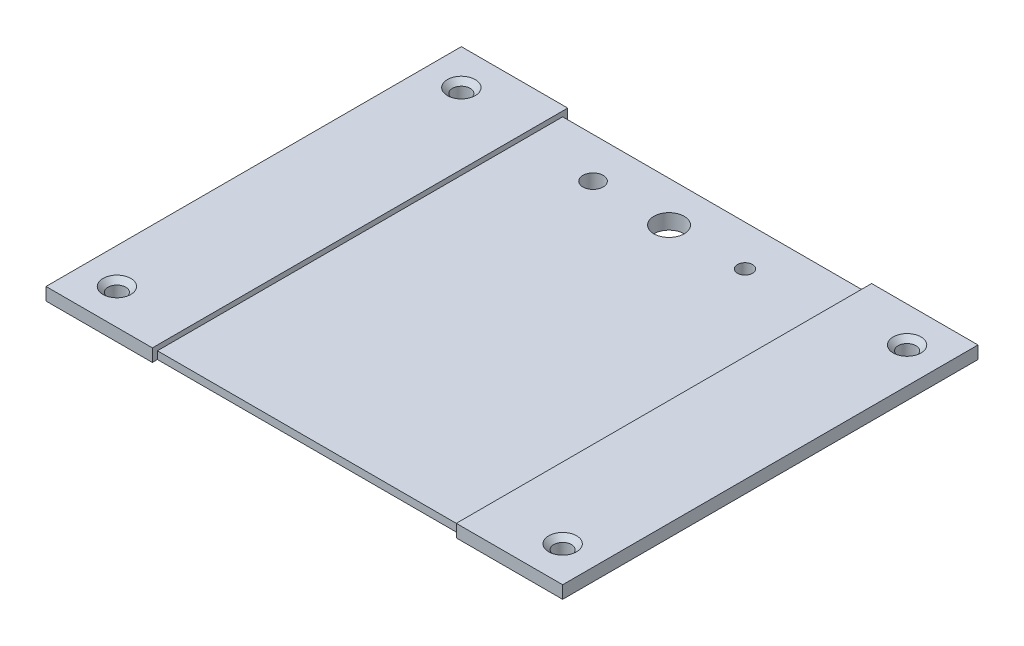
ISO-10303-21;
HEADER;
FILE_DESCRIPTION(('STEP AP214'),'2;1');
FILE_NAME('part.step','',(''),(''),'','','');
FILE_SCHEMA(('AUTOMOTIVE_DESIGN { 1 0 10303 214 1 1 1 1 }'));
ENDSEC;
DATA;
#1=APPLICATION_CONTEXT('core data for automotive mechanical design processes');
#2=APPLICATION_PROTOCOL_DEFINITION('international standard','automotive_design',2000,#1);
#3=PRODUCT_CONTEXT('',#1,'mechanical');
#4=PRODUCT('Part','Part','',(#3));
#5=PRODUCT_RELATED_PRODUCT_CATEGORY('part','',(#4));
#6=PRODUCT_DEFINITION_FORMATION('','',#4);
#7=PRODUCT_DEFINITION_CONTEXT('part definition',#1,'design');
#8=PRODUCT_DEFINITION('design','',#6,#7);
#9=PRODUCT_DEFINITION_SHAPE('','',#8);
#10=(LENGTH_UNIT() NAMED_UNIT(*) SI_UNIT(.MILLI.,.METRE.));
#11=(NAMED_UNIT(*) PLANE_ANGLE_UNIT() SI_UNIT($,.RADIAN.));
#12=(NAMED_UNIT(*) SI_UNIT($,.STERADIAN.) SOLID_ANGLE_UNIT());
#13=UNCERTAINTY_MEASURE_WITH_UNIT(LENGTH_MEASURE(1.E-05),#10,'distance_accuracy_value','');
#14=(GEOMETRIC_REPRESENTATION_CONTEXT(3) GLOBAL_UNCERTAINTY_ASSIGNED_CONTEXT((#13)) GLOBAL_UNIT_ASSIGNED_CONTEXT((#10,
#11,#12)) REPRESENTATION_CONTEXT('',''));
#15=CARTESIAN_POINT('',(0.,0.,0.));
#16=DIRECTION('',(0.,0.,1.));
#17=DIRECTION('',(1.,0.,0.));
#18=AXIS2_PLACEMENT_3D('',#15,#16,#17);
#19=CARTESIAN_POINT('',(0.,1.5,-80.));
#20=DIRECTION('',(0.,0.,1.));
#21=DIRECTION('',(1.,0.,0.));
#22=AXIS2_PLACEMENT_3D('',#19,#20,#21);
#23=PLANE('',#22);
#24=DIRECTION('',(0.,-1.,0.));
#25=VECTOR('',#24,1.);
#26=CARTESIAN_POINT('',(21.,2.5,-80.));
#27=LINE('',#26,#25);
#28=CARTESIAN_POINT('',(21.,1.5,-80.));
#29=VERTEX_POINT('',#28);
#30=CARTESIAN_POINT('',(21.,0.,-80.));
#31=VERTEX_POINT('',#30);
#32=EDGE_CURVE('E174',#29,#31,#27,.T.);
#33=ORIENTED_EDGE('',*,*,#32,.F.);
#34=DIRECTION('',(-1.,0.,0.));
#35=VECTOR('',#34,1.);
#36=CARTESIAN_POINT('',(0.,1.5,-80.));
#37=LINE('',#36,#35);
#38=CARTESIAN_POINT('',(81.,1.5,-80.));
#39=VERTEX_POINT('',#38);
#40=EDGE_CURVE('E247',#39,#29,#37,.T.);
#41=ORIENTED_EDGE('',*,*,#40,.F.);
#42=DIRECTION('',(0.,1.,0.));
#43=VECTOR('',#42,1.);
#44=CARTESIAN_POINT('',(81.,2.5,-80.));
#45=LINE('',#44,#43);
#46=CARTESIAN_POINT('',(81.,0.,-80.));
#47=VERTEX_POINT('',#46);
#48=EDGE_CURVE('E177',#47,#39,#45,.T.);
#49=ORIENTED_EDGE('',*,*,#48,.F.);
#50=DIRECTION('',(-1.,0.,0.));
#51=VECTOR('',#50,1.);
#52=CARTESIAN_POINT('',(0.,0.,-80.));
#53=LINE('',#52,#51);
#54=EDGE_CURVE('E52',#47,#31,#53,.T.);
#55=ORIENTED_EDGE('',*,*,#54,.T.);
#56=EDGE_LOOP('',(#33,#41,#49,#55));
#57=FACE_BOUND('',#56,.T.);
#58=ADVANCED_FACE('F35',(#57),#23,.F.);
#59=CARTESIAN_POINT('',(0.,1.5,0.));
#60=DIRECTION('',(0.,0.,-1.));
#61=DIRECTION('',(-1.,0.,0.));
#62=AXIS2_PLACEMENT_3D('',#59,#60,#61);
#63=PLANE('',#62);
#64=DIRECTION('',(0.,-1.,0.));
#65=VECTOR('',#64,1.);
#66=CARTESIAN_POINT('',(81.,2.5,0.));
#67=LINE('',#66,#65);
#68=CARTESIAN_POINT('',(81.,1.5,0.));
#69=VERTEX_POINT('',#68);
#70=CARTESIAN_POINT('',(81.,0.,0.));
#71=VERTEX_POINT('',#70);
#72=EDGE_CURVE('E201',#69,#71,#67,.T.);
#73=ORIENTED_EDGE('',*,*,#72,.F.);
#74=DIRECTION('',(1.,0.,0.));
#75=VECTOR('',#74,1.);
#76=CARTESIAN_POINT('',(0.,1.5,0.));
#77=LINE('',#76,#75);
#78=CARTESIAN_POINT('',(21.,1.5,0.));
#79=VERTEX_POINT('',#78);
#80=EDGE_CURVE('E250',#79,#69,#77,.T.);
#81=ORIENTED_EDGE('',*,*,#80,.F.);
#82=DIRECTION('',(0.,1.,0.));
#83=VECTOR('',#82,1.);
#84=CARTESIAN_POINT('',(21.,2.5,0.));
#85=LINE('',#84,#83);
#86=CARTESIAN_POINT('',(21.,0.,0.));
#87=VERTEX_POINT('',#86);
#88=EDGE_CURVE('E218',#87,#79,#85,.T.);
#89=ORIENTED_EDGE('',*,*,#88,.F.);
#90=DIRECTION('',(1.,0.,0.));
#91=VECTOR('',#90,1.);
#92=CARTESIAN_POINT('',(0.,0.,0.));
#93=LINE('',#92,#91);
#94=EDGE_CURVE('E60',#87,#71,#93,.T.);
#95=ORIENTED_EDGE('',*,*,#94,.T.);
#96=EDGE_LOOP('',(#73,#81,#89,#95));
#97=FACE_BOUND('',#96,.T.);
#98=ADVANCED_FACE('F311',(#97),#63,.F.);
#99=CARTESIAN_POINT('',(0.,1.5,0.));
#100=DIRECTION('',(0.,-1.,0.));
#101=DIRECTION('',(0.,0.,-1.));
#102=AXIS2_PLACEMENT_3D('',#99,#100,#101);
#103=PLANE('',#102);
#104=CARTESIAN_POINT('',(65.,1.5,-72.));
#105=DIRECTION('',(0.,1.,0.));
#106=DIRECTION('',(0.,0.,1.));
#107=AXIS2_PLACEMENT_3D('',#104,#105,#106);
#108=CIRCLE('',#107,1.49999999999998);
#109=CARTESIAN_POINT('',(65.,1.5,-70.5));
#110=VERTEX_POINT('',#109);
#111=EDGE_CURVE('E240',#110,#110,#108,.T.);
#112=ORIENTED_EDGE('',*,*,#111,.F.);
#113=EDGE_LOOP('',(#112));
#114=FACE_BOUND('',#113,.T.);
#115=CARTESIAN_POINT('',(50.,1.5,-72.));
#116=DIRECTION('',(0.,1.,0.));
#117=DIRECTION('',(0.,0.,1.));
#118=AXIS2_PLACEMENT_3D('',#115,#116,#117);
#119=CIRCLE('',#118,3.);
#120=CARTESIAN_POINT('',(50.,1.5,-69.));
#121=VERTEX_POINT('',#120);
#122=EDGE_CURVE('E297',#121,#121,#119,.T.);
#123=ORIENTED_EDGE('',*,*,#122,.F.);
#124=EDGE_LOOP('',(#123));
#125=FACE_BOUND('',#124,.T.);
#126=CARTESIAN_POINT('',(35.,1.5,-72.));
#127=DIRECTION('',(0.,1.,0.));
#128=DIRECTION('',(0.,0.,1.));
#129=AXIS2_PLACEMENT_3D('',#126,#127,#128);
#130=CIRCLE('',#129,2.);
#131=CARTESIAN_POINT('',(35.,1.5,-70.));
#132=VERTEX_POINT('',#131);
#133=EDGE_CURVE('E294',#132,#132,#130,.T.);
#134=ORIENTED_EDGE('',*,*,#133,.F.);
#135=EDGE_LOOP('',(#134));
#136=FACE_BOUND('',#135,.T.);
#137=DIRECTION('',(0.,0.,-1.));
#138=VECTOR('',#137,1.);
#139=CARTESIAN_POINT('',(21.,1.5,-80.));
#140=LINE('',#139,#138);
#141=EDGE_CURVE('E233',#79,#29,#140,.T.);
#142=ORIENTED_EDGE('',*,*,#141,.F.);
#143=ORIENTED_EDGE('',*,*,#80,.T.);
#144=DIRECTION('',(0.,0.,1.));
#145=VECTOR('',#144,1.);
#146=CARTESIAN_POINT('',(81.,1.5,-80.));
#147=LINE('',#146,#145);
#148=EDGE_CURVE('E235',#39,#69,#147,.T.);
#149=ORIENTED_EDGE('',*,*,#148,.F.);
#150=ORIENTED_EDGE('',*,*,#40,.T.);
#151=EDGE_LOOP('',(#142,#143,#149,#150));
#152=FACE_BOUND('',#151,.T.);
#153=ADVANCED_FACE('F308',(#114,#125,#136,#152),#103,.F.);
#154=CARTESIAN_POINT('',(0.,0.,0.));
#155=DIRECTION('',(0.,-1.,0.));
#156=DIRECTION('',(0.,0.,-1.));
#157=AXIS2_PLACEMENT_3D('',#154,#155,#156);
#158=PLANE('',#157);
#159=DIRECTION('',(0.,0.,1.));
#160=VECTOR('',#159,1.);
#161=CARTESIAN_POINT('',(0.,0.,0.));
#162=LINE('',#161,#160);
#163=CARTESIAN_POINT('',(0.,0.,-81.));
#164=VERTEX_POINT('',#163);
#165=CARTESIAN_POINT('',(0.,0.,1.));
#166=VERTEX_POINT('',#165);
#167=EDGE_CURVE('E161',#164,#166,#162,.T.);
#168=ORIENTED_EDGE('',*,*,#167,.F.);
#169=DIRECTION('',(-1.,0.,0.));
#170=VECTOR('',#169,1.);
#171=CARTESIAN_POINT('',(21.,0.,-81.));
#172=LINE('',#171,#170);
#173=CARTESIAN_POINT('',(21.,0.,-81.));
#174=VERTEX_POINT('',#173);
#175=EDGE_CURVE('E154',#174,#164,#172,.T.);
#176=ORIENTED_EDGE('',*,*,#175,.F.);
#177=DIRECTION('',(0.,0.,1.));
#178=VECTOR('',#177,1.);
#179=CARTESIAN_POINT('',(21.,0.,-81.));
#180=LINE('',#179,#178);
#181=EDGE_CURVE('E159',#174,#31,#180,.T.);
#182=ORIENTED_EDGE('',*,*,#181,.T.);
#183=ORIENTED_EDGE('',*,*,#54,.F.);
#184=DIRECTION('',(0.,0.,1.));
#185=VECTOR('',#184,1.);
#186=CARTESIAN_POINT('',(81.,0.,-81.));
#187=LINE('',#186,#185);
#188=CARTESIAN_POINT('',(81.,0.,-81.));
#189=VERTEX_POINT('',#188);
#190=EDGE_CURVE('E194',#189,#47,#187,.T.);
#191=ORIENTED_EDGE('',*,*,#190,.F.);
#192=DIRECTION('',(-1.,0.,0.));
#193=VECTOR('',#192,1.);
#194=CARTESIAN_POINT('',(81.,0.,-81.));
#195=LINE('',#194,#193);
#196=CARTESIAN_POINT('',(102.,0.,-81.));
#197=VERTEX_POINT('',#196);
#198=EDGE_CURVE('E192',#197,#189,#195,.T.);
#199=ORIENTED_EDGE('',*,*,#198,.F.);
#200=DIRECTION('',(0.,0.,-1.));
#201=VECTOR('',#200,1.);
#202=CARTESIAN_POINT('',(102.,0.,0.));
#203=LINE('',#202,#201);
#204=CARTESIAN_POINT('',(102.,0.,1.));
#205=VERTEX_POINT('',#204);
#206=EDGE_CURVE('E265',#205,#197,#203,.T.);
#207=ORIENTED_EDGE('',*,*,#206,.F.);
#208=DIRECTION('',(1.,0.,0.));
#209=VECTOR('',#208,1.);
#210=CARTESIAN_POINT('',(102.,0.,1.));
#211=LINE('',#210,#209);
#212=CARTESIAN_POINT('',(81.,0.,1.));
#213=VERTEX_POINT('',#212);
#214=EDGE_CURVE('E206',#213,#205,#211,.T.);
#215=ORIENTED_EDGE('',*,*,#214,.F.);
#216=DIRECTION('',(0.,0.,-1.));
#217=VECTOR('',#216,1.);
#218=CARTESIAN_POINT('',(81.,0.,1.));
#219=LINE('',#218,#217);
#220=EDGE_CURVE('E209',#213,#71,#219,.T.);
#221=ORIENTED_EDGE('',*,*,#220,.T.);
#222=ORIENTED_EDGE('',*,*,#94,.F.);
#223=DIRECTION('',(0.,0.,-1.));
#224=VECTOR('',#223,1.);
#225=CARTESIAN_POINT('',(21.,0.,1.));
#226=LINE('',#225,#224);
#227=CARTESIAN_POINT('',(21.,0.,1.));
#228=VERTEX_POINT('',#227);
#229=EDGE_CURVE('E226',#228,#87,#226,.T.);
#230=ORIENTED_EDGE('',*,*,#229,.F.);
#231=DIRECTION('',(1.,0.,0.));
#232=VECTOR('',#231,1.);
#233=CARTESIAN_POINT('',(0.,0.,1.));
#234=LINE('',#233,#232);
#235=EDGE_CURVE('E217',#166,#228,#234,.T.);
#236=ORIENTED_EDGE('',*,*,#235,.F.);
#237=EDGE_LOOP('',(#168,#176,#182,#183,#191,#199,#207,#215,#221,#222,#230,#236));
#238=FACE_BOUND('',#237,.T.);
#239=DIRECTION('',(1.,0.,0.));
#240=VECTOR('',#239,1.);
#241=CARTESIAN_POINT('',(3.00000000000001,0.,-78.));
#242=LINE('',#241,#240);
#243=CARTESIAN_POINT('',(3.00000000000001,0.,-78.));
#244=VERTEX_POINT('',#243);
#245=CARTESIAN_POINT('',(99.,0.,-78.));
#246=VERTEX_POINT('',#245);
#247=EDGE_CURVE('E426',#244,#246,#242,.T.);
#248=ORIENTED_EDGE('',*,*,#247,.F.);
#249=DIRECTION('',(0.,0.,-1.));
#250=VECTOR('',#249,1.);
#251=CARTESIAN_POINT('',(3.,0.,-2.));
#252=LINE('',#251,#250);
#253=CARTESIAN_POINT('',(3.,0.,-2.));
#254=VERTEX_POINT('',#253);
#255=EDGE_CURVE('E281',#254,#244,#252,.T.);
#256=ORIENTED_EDGE('',*,*,#255,.F.);
#257=DIRECTION('',(-1.,0.,0.));
#258=VECTOR('',#257,1.);
#259=CARTESIAN_POINT('',(3.,0.,-2.));
#260=LINE('',#259,#258);
#261=CARTESIAN_POINT('',(99.,0.,-2.));
#262=VERTEX_POINT('',#261);
#263=EDGE_CURVE('E405',#262,#254,#260,.T.);
#264=ORIENTED_EDGE('',*,*,#263,.F.);
#265=DIRECTION('',(0.,0.,1.));
#266=VECTOR('',#265,1.);
#267=CARTESIAN_POINT('',(99.,0.,-2.));
#268=LINE('',#267,#266);
#269=EDGE_CURVE('E424',#246,#262,#268,.T.);
#270=ORIENTED_EDGE('',*,*,#269,.F.);
#271=EDGE_LOOP('',(#248,#256,#264,#270));
#272=FACE_BOUND('',#271,.T.);
#273=ADVANCED_FACE('F156',(#238,#272),#158,.T.);
#274=CARTESIAN_POINT('',(0.,1.5,0.));
#275=DIRECTION('',(1.,0.,0.));
#276=DIRECTION('',(0.,0.,-1.));
#277=AXIS2_PLACEMENT_3D('',#274,#275,#276);
#278=PLANE('',#277);
#279=ORIENTED_EDGE('',*,*,#167,.T.);
#280=DIRECTION('',(0.,-1.,0.));
#281=VECTOR('',#280,1.);
#282=CARTESIAN_POINT('',(0.,2.5,1.));
#283=LINE('',#282,#281);
#284=CARTESIAN_POINT('',(0.,2.5,1.));
#285=VERTEX_POINT('',#284);
#286=EDGE_CURVE('E214',#285,#166,#283,.T.);
#287=ORIENTED_EDGE('',*,*,#286,.F.);
#288=DIRECTION('',(0.,0.,1.));
#289=VECTOR('',#288,1.);
#290=CARTESIAN_POINT('',(0.,2.5,-80.));
#291=LINE('',#290,#289);
#292=CARTESIAN_POINT('',(0.,2.5,-81.));
#293=VERTEX_POINT('',#292);
#294=EDGE_CURVE('E230',#293,#285,#291,.T.);
#295=ORIENTED_EDGE('',*,*,#294,.F.);
#296=DIRECTION('',(0.,1.,0.));
#297=VECTOR('',#296,1.);
#298=CARTESIAN_POINT('',(0.,2.5,-81.));
#299=LINE('',#298,#297);
#300=EDGE_CURVE('E165',#164,#293,#299,.T.);
#301=ORIENTED_EDGE('',*,*,#300,.F.);
#302=EDGE_LOOP('',(#279,#287,#295,#301));
#303=FACE_BOUND('',#302,.T.);
#304=ADVANCED_FACE('F456',(#303),#278,.F.);
#305=CARTESIAN_POINT('',(102.,1.5,0.));
#306=DIRECTION('',(-1.,0.,0.));
#307=DIRECTION('',(0.,0.,1.));
#308=AXIS2_PLACEMENT_3D('',#305,#306,#307);
#309=PLANE('',#308);
#310=ORIENTED_EDGE('',*,*,#206,.T.);
#311=DIRECTION('',(0.,-1.,0.));
#312=VECTOR('',#311,1.);
#313=CARTESIAN_POINT('',(102.,2.5,-81.));
#314=LINE('',#313,#312);
#315=CARTESIAN_POINT('',(102.,2.5,-81.));
#316=VERTEX_POINT('',#315);
#317=EDGE_CURVE('E189',#316,#197,#314,.T.);
#318=ORIENTED_EDGE('',*,*,#317,.F.);
#319=DIRECTION('',(0.,0.,-1.));
#320=VECTOR('',#319,1.);
#321=CARTESIAN_POINT('',(102.,2.5,-80.));
#322=LINE('',#321,#320);
#323=CARTESIAN_POINT('',(102.,2.5,1.));
#324=VERTEX_POINT('',#323);
#325=EDGE_CURVE('E236',#324,#316,#322,.T.);
#326=ORIENTED_EDGE('',*,*,#325,.F.);
#327=DIRECTION('',(0.,1.,0.));
#328=VECTOR('',#327,1.);
#329=CARTESIAN_POINT('',(102.,2.5,1.));
#330=LINE('',#329,#328);
#331=EDGE_CURVE('E197',#205,#324,#330,.T.);
#332=ORIENTED_EDGE('',*,*,#331,.F.);
#333=EDGE_LOOP('',(#310,#318,#326,#332));
#334=FACE_BOUND('',#333,.T.);
#335=ADVANCED_FACE('F335',(#334),#309,.F.);
#336=CARTESIAN_POINT('',(3.,-1.5,-2.));
#337=DIRECTION('',(1.,0.,0.));
#338=DIRECTION('',(0.,0.,-1.));
#339=AXIS2_PLACEMENT_3D('',#336,#337,#338);
#340=PLANE('',#339);
#341=ORIENTED_EDGE('',*,*,#255,.T.);
#342=DIRECTION('',(0.,1.,0.));
#343=VECTOR('',#342,1.);
#344=CARTESIAN_POINT('',(3.00000000000001,-1.5,-78.));
#345=LINE('',#344,#343);
#346=CARTESIAN_POINT('',(3.00000000000001,-1.5,-78.));
#347=VERTEX_POINT('',#346);
#348=EDGE_CURVE('E258',#347,#244,#345,.T.);
#349=ORIENTED_EDGE('',*,*,#348,.F.);
#350=DIRECTION('',(0.,0.,-1.));
#351=VECTOR('',#350,1.);
#352=CARTESIAN_POINT('',(3.,-1.5,-2.));
#353=LINE('',#352,#351);
#354=CARTESIAN_POINT('',(3.,-1.5,-2.));
#355=VERTEX_POINT('',#354);
#356=EDGE_CURVE('E396',#355,#347,#353,.T.);
#357=ORIENTED_EDGE('',*,*,#356,.F.);
#358=DIRECTION('',(0.,1.,0.));
#359=VECTOR('',#358,1.);
#360=CARTESIAN_POINT('',(3.,-1.5,-2.));
#361=LINE('',#360,#359);
#362=EDGE_CURVE('E419',#355,#254,#361,.T.);
#363=ORIENTED_EDGE('',*,*,#362,.T.);
#364=EDGE_LOOP('',(#341,#349,#357,#363));
#365=FACE_BOUND('',#364,.T.);
#366=ADVANCED_FACE('F408',(#365),#340,.F.);
#367=CARTESIAN_POINT('',(3.00000000000001,-1.5,-78.));
#368=DIRECTION('',(0.,0.,1.));
#369=DIRECTION('',(1.,0.,0.));
#370=AXIS2_PLACEMENT_3D('',#367,#368,#369);
#371=PLANE('',#370);
#372=ORIENTED_EDGE('',*,*,#247,.T.);
#373=DIRECTION('',(0.,1.,0.));
#374=VECTOR('',#373,1.);
#375=CARTESIAN_POINT('',(99.,-1.5,-78.));
#376=LINE('',#375,#374);
#377=CARTESIAN_POINT('',(99.,-1.5,-78.));
#378=VERTEX_POINT('',#377);
#379=EDGE_CURVE('E412',#378,#246,#376,.T.);
#380=ORIENTED_EDGE('',*,*,#379,.F.);
#381=DIRECTION('',(1.,0.,0.));
#382=VECTOR('',#381,1.);
#383=CARTESIAN_POINT('',(3.00000000000001,-1.5,-78.));
#384=LINE('',#383,#382);
#385=EDGE_CURVE('E398',#347,#378,#384,.T.);
#386=ORIENTED_EDGE('',*,*,#385,.F.);
#387=ORIENTED_EDGE('',*,*,#348,.T.);
#388=EDGE_LOOP('',(#372,#380,#386,#387));
#389=FACE_BOUND('',#388,.T.);
#390=ADVANCED_FACE('F486',(#389),#371,.F.);
#391=CARTESIAN_POINT('',(99.,-1.5,-2.));
#392=DIRECTION('',(-1.,0.,0.));
#393=DIRECTION('',(0.,0.,1.));
#394=AXIS2_PLACEMENT_3D('',#391,#392,#393);
#395=PLANE('',#394);
#396=ORIENTED_EDGE('',*,*,#269,.T.);
#397=DIRECTION('',(0.,1.,0.));
#398=VECTOR('',#397,1.);
#399=CARTESIAN_POINT('',(99.,-1.5,-2.));
#400=LINE('',#399,#398);
#401=CARTESIAN_POINT('',(99.,-1.5,-2.));
#402=VERTEX_POINT('',#401);
#403=EDGE_CURVE('E414',#402,#262,#400,.T.);
#404=ORIENTED_EDGE('',*,*,#403,.F.);
#405=DIRECTION('',(0.,0.,1.));
#406=VECTOR('',#405,1.);
#407=CARTESIAN_POINT('',(99.,-1.5,-2.));
#408=LINE('',#407,#406);
#409=EDGE_CURVE('E430',#378,#402,#408,.T.);
#410=ORIENTED_EDGE('',*,*,#409,.F.);
#411=ORIENTED_EDGE('',*,*,#379,.T.);
#412=EDGE_LOOP('',(#396,#404,#410,#411));
#413=FACE_BOUND('',#412,.T.);
#414=ADVANCED_FACE('F482',(#413),#395,.F.);
#415=CARTESIAN_POINT('',(3.,-1.5,-2.));
#416=DIRECTION('',(0.,0.,-1.));
#417=DIRECTION('',(-1.,0.,0.));
#418=AXIS2_PLACEMENT_3D('',#415,#416,#417);
#419=PLANE('',#418);
#420=ORIENTED_EDGE('',*,*,#263,.T.);
#421=ORIENTED_EDGE('',*,*,#362,.F.);
#422=DIRECTION('',(-1.,0.,0.));
#423=VECTOR('',#422,1.);
#424=CARTESIAN_POINT('',(3.,-1.5,-2.));
#425=LINE('',#424,#423);
#426=EDGE_CURVE('E401',#402,#355,#425,.T.);
#427=ORIENTED_EDGE('',*,*,#426,.F.);
#428=ORIENTED_EDGE('',*,*,#403,.T.);
#429=EDGE_LOOP('',(#420,#421,#427,#428));
#430=FACE_BOUND('',#429,.T.);
#431=ADVANCED_FACE('F387',(#430),#419,.F.);
#432=CARTESIAN_POINT('',(0.,-1.5,0.));
#433=DIRECTION('',(0.,-1.,0.));
#434=DIRECTION('',(0.,0.,-1.));
#435=AXIS2_PLACEMENT_3D('',#432,#433,#434);
#436=PLANE('',#435);
#437=CARTESIAN_POINT('',(65.,-1.5,-72.));
#438=DIRECTION('',(0.,-1.,0.));
#439=DIRECTION('',(0.,0.,-1.));
#440=AXIS2_PLACEMENT_3D('',#437,#438,#439);
#441=CIRCLE('',#440,1.49999999999998);
#442=CARTESIAN_POINT('',(65.,-1.5,-73.5));
#443=VERTEX_POINT('',#442);
#444=EDGE_CURVE('E298',#443,#443,#441,.T.);
#445=ORIENTED_EDGE('',*,*,#444,.F.);
#446=EDGE_LOOP('',(#445));
#447=FACE_BOUND('',#446,.T.);
#448=CARTESIAN_POINT('',(50.,-1.5,-72.));
#449=DIRECTION('',(0.,-1.,0.));
#450=DIRECTION('',(0.,0.,-1.));
#451=AXIS2_PLACEMENT_3D('',#448,#449,#450);
#452=CIRCLE('',#451,3.);
#453=CARTESIAN_POINT('',(50.,-1.5,-75.));
#454=VERTEX_POINT('',#453);
#455=EDGE_CURVE('E295',#454,#454,#452,.T.);
#456=ORIENTED_EDGE('',*,*,#455,.F.);
#457=EDGE_LOOP('',(#456));
#458=FACE_BOUND('',#457,.T.);
#459=CARTESIAN_POINT('',(35.,-1.5,-72.));
#460=DIRECTION('',(0.,-1.,0.));
#461=DIRECTION('',(0.,0.,-1.));
#462=AXIS2_PLACEMENT_3D('',#459,#460,#461);
#463=CIRCLE('',#462,2.);
#464=CARTESIAN_POINT('',(35.,-1.5,-74.));
#465=VERTEX_POINT('',#464);
#466=EDGE_CURVE('E291',#465,#465,#463,.T.);
#467=ORIENTED_EDGE('',*,*,#466,.F.);
#468=EDGE_LOOP('',(#467));
#469=FACE_BOUND('',#468,.T.);
#470=CARTESIAN_POINT('',(95.,-1.5,-74.));
#471=DIRECTION('',(0.,-1.,0.));
#472=DIRECTION('',(0.,0.,-1.));
#473=AXIS2_PLACEMENT_3D('',#470,#471,#472);
#474=CIRCLE('',#473,1.75);
#475=CARTESIAN_POINT('',(95.,-1.5,-75.75));
#476=VERTEX_POINT('',#475);
#477=EDGE_CURVE('E288',#476,#476,#474,.T.);
#478=ORIENTED_EDGE('',*,*,#477,.F.);
#479=EDGE_LOOP('',(#478));
#480=FACE_BOUND('',#479,.T.);
#481=CARTESIAN_POINT('',(95.,-1.5,-6.));
#482=DIRECTION('',(0.,-1.,0.));
#483=DIRECTION('',(0.,0.,-1.));
#484=AXIS2_PLACEMENT_3D('',#481,#482,#483);
#485=CIRCLE('',#484,1.75);
#486=CARTESIAN_POINT('',(95.,-1.5,-7.75));
#487=VERTEX_POINT('',#486);
#488=EDGE_CURVE('E285',#487,#487,#485,.T.);
#489=ORIENTED_EDGE('',*,*,#488,.F.);
#490=EDGE_LOOP('',(#489));
#491=FACE_BOUND('',#490,.T.);
#492=CARTESIAN_POINT('',(7.,-1.5,-6.00000000000001));
#493=DIRECTION('',(0.,-1.,0.));
#494=DIRECTION('',(0.,0.,-1.));
#495=AXIS2_PLACEMENT_3D('',#492,#493,#494);
#496=CIRCLE('',#495,1.75);
#497=CARTESIAN_POINT('',(7.,-1.5,-7.75000000000001));
#498=VERTEX_POINT('',#497);
#499=EDGE_CURVE('E282',#498,#498,#496,.T.);
#500=ORIENTED_EDGE('',*,*,#499,.F.);
#501=EDGE_LOOP('',(#500));
#502=FACE_BOUND('',#501,.T.);
#503=CARTESIAN_POINT('',(7.,-1.5,-74.));
#504=DIRECTION('',(0.,-1.,0.));
#505=DIRECTION('',(0.,0.,-1.));
#506=AXIS2_PLACEMENT_3D('',#503,#504,#505);
#507=CIRCLE('',#506,1.75);
#508=CARTESIAN_POINT('',(7.,-1.5,-75.75));
#509=VERTEX_POINT('',#508);
#510=EDGE_CURVE('E278',#509,#509,#507,.T.);
#511=ORIENTED_EDGE('',*,*,#510,.F.);
#512=EDGE_LOOP('',(#511));
#513=FACE_BOUND('',#512,.T.);
#514=ORIENTED_EDGE('',*,*,#356,.T.);
#515=ORIENTED_EDGE('',*,*,#385,.T.);
#516=ORIENTED_EDGE('',*,*,#409,.T.);
#517=ORIENTED_EDGE('',*,*,#426,.T.);
#518=EDGE_LOOP('',(#514,#515,#516,#517));
#519=FACE_BOUND('',#518,.T.);
#520=ADVANCED_FACE('F383',(#447,#458,#469,#480,#491,#502,#513,#519),#436,.T.);
#521=CARTESIAN_POINT('',(7.,-3.5,-74.));
#522=DIRECTION('',(0.,1.,0.));
#523=DIRECTION('',(0.,0.,1.));
#524=AXIS2_PLACEMENT_3D('',#521,#522,#523);
#525=CYLINDRICAL_SURFACE('',#524,1.75);
#526=CARTESIAN_POINT('',(7.,1.49999999999998,-74.));
#527=DIRECTION('',(0.,1.,0.));
#528=DIRECTION('',(0.,0.,1.));
#529=AXIS2_PLACEMENT_3D('',#526,#527,#528);
#530=CIRCLE('',#529,1.75);
#531=CARTESIAN_POINT('',(7.,1.49999999999998,-72.25));
#532=VERTEX_POINT('',#531);
#533=EDGE_CURVE('E254',#532,#532,#530,.T.);
#534=ORIENTED_EDGE('',*,*,#533,.T.);
#535=EDGE_LOOP('',(#534));
#536=FACE_BOUND('',#535,.T.);
#537=ORIENTED_EDGE('',*,*,#510,.T.);
#538=EDGE_LOOP('',(#537));
#539=FACE_BOUND('',#538,.T.);
#540=ADVANCED_FACE('F386',(#536,#539),#525,.F.);
#541=CARTESIAN_POINT('',(7.,-3.5,-6.00000000000001));
#542=DIRECTION('',(0.,1.,0.));
#543=DIRECTION('',(0.,0.,1.));
#544=AXIS2_PLACEMENT_3D('',#541,#542,#543);
#545=CYLINDRICAL_SURFACE('',#544,1.75);
#546=CARTESIAN_POINT('',(7.,1.49999999999998,-6.00000000000001));
#547=DIRECTION('',(0.,1.,0.));
#548=DIRECTION('',(0.,0.,1.));
#549=AXIS2_PLACEMENT_3D('',#546,#547,#548);
#550=CIRCLE('',#549,1.75);
#551=CARTESIAN_POINT('',(7.,1.49999999999998,-4.25));
#552=VERTEX_POINT('',#551);
#553=EDGE_CURVE('E354',#552,#552,#550,.T.);
#554=ORIENTED_EDGE('',*,*,#553,.T.);
#555=EDGE_LOOP('',(#554));
#556=FACE_BOUND('',#555,.T.);
#557=ORIENTED_EDGE('',*,*,#499,.T.);
#558=EDGE_LOOP('',(#557));
#559=FACE_BOUND('',#558,.T.);
#560=ADVANCED_FACE('F379',(#556,#559),#545,.F.);
#561=CARTESIAN_POINT('',(95.,-3.5,-6.));
#562=DIRECTION('',(0.,1.,0.));
#563=DIRECTION('',(0.,0.,1.));
#564=AXIS2_PLACEMENT_3D('',#561,#562,#563);
#565=CYLINDRICAL_SURFACE('',#564,1.75);
#566=CARTESIAN_POINT('',(95.,1.50000000000002,-6.));
#567=DIRECTION('',(0.,-1.,0.));
#568=DIRECTION('',(0.,0.,-1.));
#569=AXIS2_PLACEMENT_3D('',#566,#567,#568);
#570=CIRCLE('',#569,1.75);
#571=CARTESIAN_POINT('',(95.,1.50000000000002,-7.75));
#572=VERTEX_POINT('',#571);
#573=EDGE_CURVE('E359',#572,#572,#570,.F.);
#574=ORIENTED_EDGE('',*,*,#573,.T.);
#575=EDGE_LOOP('',(#574));
#576=FACE_BOUND('',#575,.T.);
#577=ORIENTED_EDGE('',*,*,#488,.T.);
#578=EDGE_LOOP('',(#577));
#579=FACE_BOUND('',#578,.T.);
#580=ADVANCED_FACE('F375',(#576,#579),#565,.F.);
#581=CARTESIAN_POINT('',(95.,-3.5,-74.));
#582=DIRECTION('',(0.,1.,0.));
#583=DIRECTION('',(0.,0.,1.));
#584=AXIS2_PLACEMENT_3D('',#581,#582,#583);
#585=CYLINDRICAL_SURFACE('',#584,1.75);
#586=CARTESIAN_POINT('',(95.,1.49999999999999,-74.));
#587=DIRECTION('',(0.,-1.,0.));
#588=DIRECTION('',(0.,0.,-1.));
#589=AXIS2_PLACEMENT_3D('',#586,#587,#588);
#590=CIRCLE('',#589,1.75);
#591=CARTESIAN_POINT('',(95.,1.49999999999999,-75.75));
#592=VERTEX_POINT('',#591);
#593=EDGE_CURVE('E11',#592,#592,#590,.F.);
#594=ORIENTED_EDGE('',*,*,#593,.T.);
#595=EDGE_LOOP('',(#594));
#596=FACE_BOUND('',#595,.T.);
#597=ORIENTED_EDGE('',*,*,#477,.T.);
#598=EDGE_LOOP('',(#597));
#599=FACE_BOUND('',#598,.T.);
#600=ADVANCED_FACE('F378',(#596,#599),#585,.F.);
#601=CARTESIAN_POINT('',(35.,-3.5,-72.));
#602=DIRECTION('',(0.,1.,0.));
#603=DIRECTION('',(0.,0.,1.));
#604=AXIS2_PLACEMENT_3D('',#601,#602,#603);
#605=CYLINDRICAL_SURFACE('',#604,2.);
#606=ORIENTED_EDGE('',*,*,#466,.T.);
#607=EDGE_LOOP('',(#606));
#608=FACE_BOUND('',#607,.T.);
#609=ORIENTED_EDGE('',*,*,#133,.T.);
#610=EDGE_LOOP('',(#609));
#611=FACE_BOUND('',#610,.T.);
#612=ADVANCED_FACE('F434',(#608,#611),#605,.F.);
#613=CARTESIAN_POINT('',(50.,-3.5,-72.));
#614=DIRECTION('',(0.,1.,0.));
#615=DIRECTION('',(0.,0.,1.));
#616=AXIS2_PLACEMENT_3D('',#613,#614,#615);
#617=CYLINDRICAL_SURFACE('',#616,3.);
#618=ORIENTED_EDGE('',*,*,#455,.T.);
#619=EDGE_LOOP('',(#618));
#620=FACE_BOUND('',#619,.T.);
#621=ORIENTED_EDGE('',*,*,#122,.T.);
#622=EDGE_LOOP('',(#621));
#623=FACE_BOUND('',#622,.T.);
#624=ADVANCED_FACE('F436',(#620,#623),#617,.F.);
#625=CARTESIAN_POINT('',(65.,-3.5,-72.));
#626=DIRECTION('',(0.,1.,0.));
#627=DIRECTION('',(0.,0.,1.));
#628=AXIS2_PLACEMENT_3D('',#625,#626,#627);
#629=CYLINDRICAL_SURFACE('',#628,1.49999999999998);
#630=ORIENTED_EDGE('',*,*,#444,.T.);
#631=EDGE_LOOP('',(#630));
#632=FACE_BOUND('',#631,.T.);
#633=ORIENTED_EDGE('',*,*,#111,.T.);
#634=EDGE_LOOP('',(#633));
#635=FACE_BOUND('',#634,.T.);
#636=ADVANCED_FACE('F306',(#632,#635),#629,.F.);
#637=CARTESIAN_POINT('',(0.,2.5,0.));
#638=DIRECTION('',(0.,-1.,0.));
#639=DIRECTION('',(0.,0.,-1.));
#640=AXIS2_PLACEMENT_3D('',#637,#638,#639);
#641=PLANE('',#640);
#642=CARTESIAN_POINT('',(95.,2.5,-6.));
#643=DIRECTION('',(0.,-1.,0.));
#644=DIRECTION('',(0.,0.,-1.));
#645=AXIS2_PLACEMENT_3D('',#642,#643,#644);
#646=CIRCLE('',#645,2.74999999999999);
#647=CARTESIAN_POINT('',(95.,2.5,-8.74999999999999));
#648=VERTEX_POINT('',#647);
#649=EDGE_CURVE('E44',#648,#648,#646,.T.);
#650=ORIENTED_EDGE('',*,*,#649,.T.);
#651=EDGE_LOOP('',(#650));
#652=FACE_BOUND('',#651,.T.);
#653=CARTESIAN_POINT('',(95.,2.5,-74.));
#654=DIRECTION('',(0.,-1.,0.));
#655=DIRECTION('',(0.,0.,-1.));
#656=AXIS2_PLACEMENT_3D('',#653,#654,#655);
#657=CIRCLE('',#656,2.75);
#658=CARTESIAN_POINT('',(95.,2.5,-76.75));
#659=VERTEX_POINT('',#658);
#660=EDGE_CURVE('E362',#659,#659,#657,.T.);
#661=ORIENTED_EDGE('',*,*,#660,.T.);
#662=EDGE_LOOP('',(#661));
#663=FACE_BOUND('',#662,.T.);
#664=ORIENTED_EDGE('',*,*,#325,.T.);
#665=DIRECTION('',(1.,0.,0.));
#666=VECTOR('',#665,1.);
#667=CARTESIAN_POINT('',(81.,2.5,-81.));
#668=LINE('',#667,#666);
#669=CARTESIAN_POINT('',(81.,2.5,-81.));
#670=VERTEX_POINT('',#669);
#671=EDGE_CURVE('E186',#670,#316,#668,.T.);
#672=ORIENTED_EDGE('',*,*,#671,.F.);
#673=DIRECTION('',(0.,0.,1.));
#674=VECTOR('',#673,1.);
#675=CARTESIAN_POINT('',(81.,2.5,-80.));
#676=LINE('',#675,#674);
#677=CARTESIAN_POINT('',(81.,2.5,1.));
#678=VERTEX_POINT('',#677);
#679=EDGE_CURVE('E238',#670,#678,#676,.T.);
#680=ORIENTED_EDGE('',*,*,#679,.T.);
#681=DIRECTION('',(-1.,0.,0.));
#682=VECTOR('',#681,1.);
#683=CARTESIAN_POINT('',(102.,2.5,1.));
#684=LINE('',#683,#682);
#685=EDGE_CURVE('E200',#324,#678,#684,.T.);
#686=ORIENTED_EDGE('',*,*,#685,.F.);
#687=EDGE_LOOP('',(#664,#672,#680,#686));
#688=FACE_BOUND('',#687,.T.);
#689=ADVANCED_FACE('F340',(#652,#663,#688),#641,.F.);
#690=CARTESIAN_POINT('',(81.,2.5,-80.));
#691=DIRECTION('',(1.,0.,0.));
#692=DIRECTION('',(0.,0.,-1.));
#693=AXIS2_PLACEMENT_3D('',#690,#691,#692);
#694=PLANE('',#693);
#695=ORIENTED_EDGE('',*,*,#148,.T.);
#696=ORIENTED_EDGE('',*,*,#72,.T.);
#697=ORIENTED_EDGE('',*,*,#220,.F.);
#698=DIRECTION('',(0.,-1.,0.));
#699=VECTOR('',#698,1.);
#700=CARTESIAN_POINT('',(81.,2.5,1.));
#701=LINE('',#700,#699);
#702=EDGE_CURVE('E204',#678,#213,#701,.T.);
#703=ORIENTED_EDGE('',*,*,#702,.F.);
#704=ORIENTED_EDGE('',*,*,#679,.F.);
#705=DIRECTION('',(0.,1.,0.));
#706=VECTOR('',#705,1.);
#707=CARTESIAN_POINT('',(81.,2.5,-81.));
#708=LINE('',#707,#706);
#709=EDGE_CURVE('E179',#189,#670,#708,.T.);
#710=ORIENTED_EDGE('',*,*,#709,.F.);
#711=ORIENTED_EDGE('',*,*,#190,.T.);
#712=ORIENTED_EDGE('',*,*,#48,.T.);
#713=EDGE_LOOP('',(#695,#696,#697,#703,#704,#710,#711,#712));
#714=FACE_BOUND('',#713,.T.);
#715=ADVANCED_FACE('F326',(#714),#694,.F.);
#716=CARTESIAN_POINT('',(0.,2.5,0.));
#717=DIRECTION('',(0.,1.,0.));
#718=DIRECTION('',(0.,0.,1.));
#719=AXIS2_PLACEMENT_3D('',#716,#717,#718);
#720=PLANE('',#719);
#721=CARTESIAN_POINT('',(7.,2.5,-74.));
#722=DIRECTION('',(0.,1.,0.));
#723=DIRECTION('',(0.,0.,1.));
#724=AXIS2_PLACEMENT_3D('',#721,#722,#723);
#725=CIRCLE('',#724,2.75000000000003);
#726=CARTESIAN_POINT('',(7.,2.5,-71.25));
#727=VERTEX_POINT('',#726);
#728=EDGE_CURVE('E350',#727,#727,#725,.F.);
#729=ORIENTED_EDGE('',*,*,#728,.T.);
#730=EDGE_LOOP('',(#729));
#731=FACE_BOUND('',#730,.T.);
#732=CARTESIAN_POINT('',(7.,2.5,-6.00000000000001));
#733=DIRECTION('',(0.,1.,0.));
#734=DIRECTION('',(0.,0.,1.));
#735=AXIS2_PLACEMENT_3D('',#732,#733,#734);
#736=CIRCLE('',#735,2.75000000000003);
#737=CARTESIAN_POINT('',(7.,2.5,-3.24999999999998));
#738=VERTEX_POINT('',#737);
#739=EDGE_CURVE('E346',#738,#738,#736,.F.);
#740=ORIENTED_EDGE('',*,*,#739,.T.);
#741=EDGE_LOOP('',(#740));
#742=FACE_BOUND('',#741,.T.);
#743=ORIENTED_EDGE('',*,*,#294,.T.);
#744=DIRECTION('',(-1.,0.,0.));
#745=VECTOR('',#744,1.);
#746=CARTESIAN_POINT('',(0.,2.5,1.));
#747=LINE('',#746,#745);
#748=CARTESIAN_POINT('',(21.,2.5,1.));
#749=VERTEX_POINT('',#748);
#750=EDGE_CURVE('E223',#749,#285,#747,.T.);
#751=ORIENTED_EDGE('',*,*,#750,.F.);
#752=DIRECTION('',(0.,0.,-1.));
#753=VECTOR('',#752,1.);
#754=CARTESIAN_POINT('',(21.,2.5,-80.));
#755=LINE('',#754,#753);
#756=CARTESIAN_POINT('',(21.,2.5,-81.));
#757=VERTEX_POINT('',#756);
#758=EDGE_CURVE('E232',#749,#757,#755,.T.);
#759=ORIENTED_EDGE('',*,*,#758,.T.);
#760=DIRECTION('',(1.,0.,0.));
#761=VECTOR('',#760,1.);
#762=CARTESIAN_POINT('',(21.,2.5,-81.));
#763=LINE('',#762,#761);
#764=EDGE_CURVE('E172',#293,#757,#763,.T.);
#765=ORIENTED_EDGE('',*,*,#764,.F.);
#766=EDGE_LOOP('',(#743,#751,#759,#765));
#767=FACE_BOUND('',#766,.T.);
#768=ADVANCED_FACE('F647',(#731,#742,#767),#720,.T.);
#769=CARTESIAN_POINT('',(21.,2.5,-80.));
#770=DIRECTION('',(-1.,0.,0.));
#771=DIRECTION('',(0.,0.,1.));
#772=AXIS2_PLACEMENT_3D('',#769,#770,#771);
#773=PLANE('',#772);
#774=ORIENTED_EDGE('',*,*,#141,.T.);
#775=ORIENTED_EDGE('',*,*,#32,.T.);
#776=ORIENTED_EDGE('',*,*,#181,.F.);
#777=DIRECTION('',(0.,-1.,0.));
#778=VECTOR('',#777,1.);
#779=CARTESIAN_POINT('',(21.,2.5,-81.));
#780=LINE('',#779,#778);
#781=EDGE_CURVE('E166',#757,#174,#780,.T.);
#782=ORIENTED_EDGE('',*,*,#781,.F.);
#783=ORIENTED_EDGE('',*,*,#758,.F.);
#784=DIRECTION('',(0.,1.,0.));
#785=VECTOR('',#784,1.);
#786=CARTESIAN_POINT('',(21.,2.5,1.));
#787=LINE('',#786,#785);
#788=EDGE_CURVE('E220',#228,#749,#787,.T.);
#789=ORIENTED_EDGE('',*,*,#788,.F.);
#790=ORIENTED_EDGE('',*,*,#229,.T.);
#791=ORIENTED_EDGE('',*,*,#88,.T.);
#792=EDGE_LOOP('',(#774,#775,#776,#782,#783,#789,#790,#791));
#793=FACE_BOUND('',#792,.T.);
#794=ADVANCED_FACE('F176',(#793),#773,.F.);
#795=CARTESIAN_POINT('',(7.,1.49999999999998,-74.));
#796=DIRECTION('',(0.,1.,0.));
#797=DIRECTION('',(0.,0.,1.));
#798=AXIS2_PLACEMENT_3D('',#795,#796,#797);
#799=CONICAL_SURFACE('',#798,1.75,0.785398163397452);
#800=ORIENTED_EDGE('',*,*,#728,.F.);
#801=EDGE_LOOP('',(#800));
#802=FACE_BOUND('',#801,.T.);
#803=ORIENTED_EDGE('',*,*,#533,.F.);
#804=EDGE_LOOP('',(#803));
#805=FACE_BOUND('',#804,.T.);
#806=ADVANCED_FACE('F461',(#802,#805),#799,.F.);
#807=CARTESIAN_POINT('',(7.,1.49999999999998,-6.00000000000001));
#808=DIRECTION('',(0.,1.,0.));
#809=DIRECTION('',(0.,0.,1.));
#810=AXIS2_PLACEMENT_3D('',#807,#808,#809);
#811=CONICAL_SURFACE('',#810,1.75,0.785398163397452);
#812=ORIENTED_EDGE('',*,*,#739,.F.);
#813=EDGE_LOOP('',(#812));
#814=FACE_BOUND('',#813,.T.);
#815=ORIENTED_EDGE('',*,*,#553,.F.);
#816=EDGE_LOOP('',(#815));
#817=FACE_BOUND('',#816,.T.);
#818=ADVANCED_FACE('F372',(#814,#817),#811,.F.);
#819=CARTESIAN_POINT('',(95.,1.50000000000002,-6.));
#820=DIRECTION('',(0.,1.,0.));
#821=DIRECTION('',(0.,0.,1.));
#822=AXIS2_PLACEMENT_3D('',#819,#820,#821);
#823=CONICAL_SURFACE('',#822,1.75,0.785398163397452);
#824=ORIENTED_EDGE('',*,*,#649,.F.);
#825=EDGE_LOOP('',(#824));
#826=FACE_BOUND('',#825,.T.);
#827=ORIENTED_EDGE('',*,*,#573,.F.);
#828=EDGE_LOOP('',(#827));
#829=FACE_BOUND('',#828,.T.);
#830=ADVANCED_FACE('F369',(#826,#829),#823,.F.);
#831=CARTESIAN_POINT('',(95.,1.49999999999999,-74.));
#832=DIRECTION('',(0.,1.,0.));
#833=DIRECTION('',(0.,0.,1.));
#834=AXIS2_PLACEMENT_3D('',#831,#832,#833);
#835=CONICAL_SURFACE('',#834,1.75,0.785398163397445);
#836=ORIENTED_EDGE('',*,*,#660,.F.);
#837=EDGE_LOOP('',(#836));
#838=FACE_BOUND('',#837,.T.);
#839=ORIENTED_EDGE('',*,*,#593,.F.);
#840=EDGE_LOOP('',(#839));
#841=FACE_BOUND('',#840,.T.);
#842=ADVANCED_FACE('F37',(#838,#841),#835,.F.);
#843=CARTESIAN_POINT('',(0.,0.,1.));
#844=DIRECTION('',(0.,0.,1.));
#845=DIRECTION('',(1.,0.,0.));
#846=AXIS2_PLACEMENT_3D('',#843,#844,#845);
#847=PLANE('',#846);
#848=ORIENTED_EDGE('',*,*,#286,.T.);
#849=ORIENTED_EDGE('',*,*,#235,.T.);
#850=ORIENTED_EDGE('',*,*,#788,.T.);
#851=ORIENTED_EDGE('',*,*,#750,.T.);
#852=EDGE_LOOP('',(#848,#849,#850,#851));
#853=FACE_BOUND('',#852,.T.);
#854=ADVANCED_FACE('F568',(#853),#847,.T.);
#855=CARTESIAN_POINT('',(0.,0.,1.));
#856=DIRECTION('',(0.,0.,-1.));
#857=DIRECTION('',(-1.,0.,0.));
#858=AXIS2_PLACEMENT_3D('',#855,#856,#857);
#859=PLANE('',#858);
#860=ORIENTED_EDGE('',*,*,#331,.T.);
#861=ORIENTED_EDGE('',*,*,#685,.T.);
#862=ORIENTED_EDGE('',*,*,#702,.T.);
#863=ORIENTED_EDGE('',*,*,#214,.T.);
#864=EDGE_LOOP('',(#860,#861,#862,#863));
#865=FACE_BOUND('',#864,.T.);
#866=ADVANCED_FACE('F333',(#865),#859,.F.);
#867=CARTESIAN_POINT('',(0.,0.,-81.));
#868=DIRECTION('',(0.,0.,1.));
#869=DIRECTION('',(1.,0.,0.));
#870=AXIS2_PLACEMENT_3D('',#867,#868,#869);
#871=PLANE('',#870);
#872=ORIENTED_EDGE('',*,*,#709,.T.);
#873=ORIENTED_EDGE('',*,*,#671,.T.);
#874=ORIENTED_EDGE('',*,*,#317,.T.);
#875=ORIENTED_EDGE('',*,*,#198,.T.);
#876=EDGE_LOOP('',(#872,#873,#874,#875));
#877=FACE_BOUND('',#876,.T.);
#878=ADVANCED_FACE('F343',(#877),#871,.F.);
#879=CARTESIAN_POINT('',(0.,0.,-81.));
#880=DIRECTION('',(0.,0.,-1.));
#881=DIRECTION('',(-1.,0.,0.));
#882=AXIS2_PLACEMENT_3D('',#879,#880,#881);
#883=PLANE('',#882);
#884=ORIENTED_EDGE('',*,*,#781,.T.);
#885=ORIENTED_EDGE('',*,*,#175,.T.);
#886=ORIENTED_EDGE('',*,*,#300,.T.);
#887=ORIENTED_EDGE('',*,*,#764,.T.);
#888=EDGE_LOOP('',(#884,#885,#886,#887));
#889=FACE_BOUND('',#888,.T.);
#890=ADVANCED_FACE('F170',(#889),#883,.T.);
#891=CLOSED_SHELL('',(#58,#98,#153,#273,#304,#335,#366,#390,#414,#431,#520,#540,#560,#580,#600,
#612,#624,#636,#689,#715,#768,#794,#806,#818,#830,#842,#854,#866,#878,#890));
#892=MANIFOLD_SOLID_BREP('B2',#891);
#893=ADVANCED_BREP_SHAPE_REPRESENTATION('',(#18,#892),#14);
#894=SHAPE_DEFINITION_REPRESENTATION(#9,#893);
ENDSEC;
END-ISO-10303-21;
